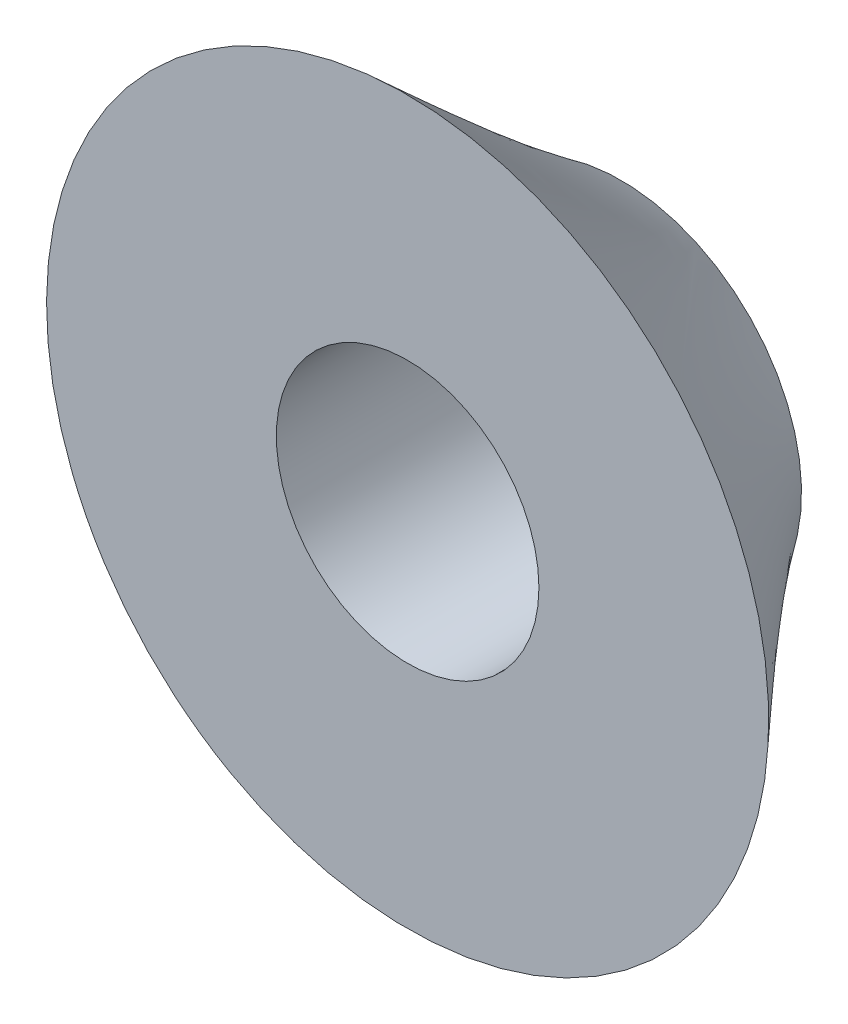
ISO-10303-21;
HEADER;
FILE_DESCRIPTION(('STEP AP214'),'2;1');
FILE_NAME('part.step','',(''),(''),'','','');
FILE_SCHEMA(('AUTOMOTIVE_DESIGN { 1 0 10303 214 1 1 1 1 }'));
ENDSEC;
DATA;
#1=APPLICATION_CONTEXT('core data for automotive mechanical design processes');
#2=APPLICATION_PROTOCOL_DEFINITION('international standard','automotive_design',2000,#1);
#3=PRODUCT_CONTEXT('',#1,'mechanical');
#4=PRODUCT('Part','Part','',(#3));
#5=PRODUCT_RELATED_PRODUCT_CATEGORY('part','',(#4));
#6=PRODUCT_DEFINITION_FORMATION('','',#4);
#7=PRODUCT_DEFINITION_CONTEXT('part definition',#1,'design');
#8=PRODUCT_DEFINITION('design','',#6,#7);
#9=PRODUCT_DEFINITION_SHAPE('','',#8);
#10=(LENGTH_UNIT() NAMED_UNIT(*) SI_UNIT(.MILLI.,.METRE.));
#11=(NAMED_UNIT(*) PLANE_ANGLE_UNIT() SI_UNIT($,.RADIAN.));
#12=(NAMED_UNIT(*) SI_UNIT($,.STERADIAN.) SOLID_ANGLE_UNIT());
#13=UNCERTAINTY_MEASURE_WITH_UNIT(LENGTH_MEASURE(1.E-05),#10,'distance_accuracy_value','');
#14=(GEOMETRIC_REPRESENTATION_CONTEXT(3) GLOBAL_UNCERTAINTY_ASSIGNED_CONTEXT((#13)) GLOBAL_UNIT_ASSIGNED_CONTEXT((#10,
#11,#12)) REPRESENTATION_CONTEXT('',''));
#15=CARTESIAN_POINT('',(0.,0.,0.));
#16=DIRECTION('',(0.,0.,1.));
#17=DIRECTION('',(1.,0.,0.));
#18=AXIS2_PLACEMENT_3D('',#15,#16,#17);
#19=CARTESIAN_POINT('',(0.,0.,6.5));
#20=DIRECTION('',(0.,0.,1.));
#21=DIRECTION('',(1.,0.,0.));
#22=AXIS2_PLACEMENT_3D('',#19,#20,#21);
#23=PLANE('',#22);
#24=CARTESIAN_POINT('',(0.,0.,6.5));
#25=DIRECTION('',(0.,0.,1.));
#26=DIRECTION('',(1.,0.,0.));
#27=AXIS2_PLACEMENT_3D('',#24,#25,#26);
#28=CIRCLE('',#27,4.);
#29=CARTESIAN_POINT('',(4.,0.,6.5));
#30=VERTEX_POINT('',#29);
#31=EDGE_CURVE('E49',#30,#30,#28,.T.);
#32=ORIENTED_EDGE('',*,*,#31,.F.);
#33=EDGE_LOOP('',(#32));
#34=FACE_BOUND('',#33,.T.);
#35=CARTESIAN_POINT('',(0.,0.,6.5));
#36=DIRECTION('',(0.,0.,1.));
#37=DIRECTION('',(1.,0.,0.));
#38=AXIS2_PLACEMENT_3D('',#35,#36,#37);
#39=CIRCLE('',#38,11.);
#40=CARTESIAN_POINT('',(8.27403430770523,7.24847268567088,6.5));
#41=VERTEX_POINT('',#40);
#42=EDGE_CURVE('E11',#41,#41,#39,.T.);
#43=ORIENTED_EDGE('',*,*,#42,.T.);
#44=EDGE_LOOP('',(#43));
#45=FACE_BOUND('',#44,.T.);
#46=ADVANCED_FACE('F35',(#34,#45),#23,.T.);
#47=CARTESIAN_POINT('',(0.,0.,0.));
#48=DIRECTION('',(0.,0.,1.));
#49=DIRECTION('',(1.,0.,0.));
#50=AXIS2_PLACEMENT_3D('',#47,#48,#49);
#51=PLANE('',#50);
#52=CARTESIAN_POINT('',(0.,0.,0.));
#53=DIRECTION('',(0.,0.,1.));
#54=DIRECTION('',(1.,0.,0.));
#55=AXIS2_PLACEMENT_3D('',#52,#53,#54);
#56=CIRCLE('',#55,4.);
#57=CARTESIAN_POINT('',(4.,0.,0.));
#58=VERTEX_POINT('',#57);
#59=EDGE_CURVE('E39',#58,#58,#56,.T.);
#60=ORIENTED_EDGE('',*,*,#59,.T.);
#61=EDGE_LOOP('',(#60));
#62=FACE_BOUND('',#61,.T.);
#63=CARTESIAN_POINT('',(0.,0.,0.));
#64=DIRECTION('',(0.,0.,1.));
#65=DIRECTION('',(1.,0.,0.));
#66=AXIS2_PLACEMENT_3D('',#63,#64,#65);
#67=CIRCLE('',#66,5.5);
#68=CARTESIAN_POINT('',(2.29477992513971,4.99839825295822,0.));
#69=VERTEX_POINT('',#68);
#70=EDGE_CURVE('E43',#69,#69,#67,.T.);
#71=ORIENTED_EDGE('',*,*,#70,.F.);
#72=EDGE_LOOP('',(#71));
#73=FACE_BOUND('',#72,.T.);
#74=ADVANCED_FACE('F69',(#62,#73),#51,.F.);
#75=CARTESIAN_POINT('',(2.29477992513971,4.99839825295822,0.));
#76=CARTESIAN_POINT('',(8.27403430770523,7.24847268567088,6.5));
#77=CARTESIAN_POINT('',(-7.70201658077673,9.58795810323764,0.));
#78=CARTESIAN_POINT('',(-6.22291106363654,23.7965413010813,6.5));
#79=CARTESIAN_POINT('',(-12.2915764310561,-0.408838402678803,0.));
#80=CARTESIAN_POINT('',(-22.770979679047,9.29959592973957,6.5));
#81=CARTESIAN_POINT('',(-2.29477992513971,-4.99839825295822,0.));
#82=CARTESIAN_POINT('',(-8.27403430770523,-7.24847268567088,6.5));
#83=CARTESIAN_POINT('',(7.70201658077673,-9.58795810323764,0.));
#84=CARTESIAN_POINT('',(6.22291106363653,-23.7965413010813,6.5));
#85=CARTESIAN_POINT('',(12.2915764310561,0.408838402678804,0.));
#86=CARTESIAN_POINT('',(22.770979679047,-9.29959592973957,6.5));
#87=CARTESIAN_POINT('',(2.29477992513971,4.99839825295822,0.));
#88=CARTESIAN_POINT('',(8.27403430770523,7.24847268567088,6.5));
#89=(BOUNDED_SURFACE() B_SPLINE_SURFACE(3,1,((#75,#76),(#77,#78),(#79,#80),(#81,#82),(#83,#84),
(#85,#86),(#87,#88)),.UNSPECIFIED.,.T.,.F.,.F.) B_SPLINE_SURFACE_WITH_KNOTS((4,3,4),(2,2),(0.,
0.5,1.),(0.,1.),.UNSPECIFIED.) GEOMETRIC_REPRESENTATION_ITEM() RATIONAL_B_SPLINE_SURFACE(((1.,
1.),(0.333333333333333,0.333333333333333),(0.333333333333333,0.333333333333333),(1.,1.),
(0.333333333333333,0.333333333333333),(0.333333333333333,0.333333333333333),(1.,1.))) REPRESENTATION_ITEM('') SURFACE());
#90=CARTESIAN_POINT('',(2.29477992513971,4.99839825295822,0.));
#91=CARTESIAN_POINT('',(2.3570638249581,5.02183652829898,0.0677083333333334));
#92=CARTESIAN_POINT('',(2.41934772477649,5.04527480363973,0.135416666666667));
#93=CARTESIAN_POINT('',(2.54391552441327,5.09215135432125,0.270833333333333));
#94=CARTESIAN_POINT('',(2.60619942423166,5.11558962966201,0.338541666666667));
#95=CARTESIAN_POINT('',(2.73076722386844,5.16246618034352,0.473958333333333));
#96=CARTESIAN_POINT('',(2.79305112368684,5.18590445568428,0.541666666666667));
#97=CARTESIAN_POINT('',(2.91761892332362,5.23278100636579,0.677083333333333));
#98=CARTESIAN_POINT('',(2.97990282314201,5.25621928170655,0.744791666666667));
#99=CARTESIAN_POINT('',(3.10447062277879,5.30309583238806,0.880208333333333));
#100=CARTESIAN_POINT('',(3.16675452259718,5.32653410772882,0.947916666666667));
#101=CARTESIAN_POINT('',(3.29132232223396,5.37341065841033,1.08333333333333));
#102=CARTESIAN_POINT('',(3.35360622205235,5.39684893375109,1.15104166666667));
#103=CARTESIAN_POINT('',(3.47817402168913,5.4437254844326,1.28645833333333));
#104=CARTESIAN_POINT('',(3.54045792150752,5.46716375977336,1.35416666666667));
#105=CARTESIAN_POINT('',(3.66502572114431,5.51404031045487,1.48958333333333));
#106=CARTESIAN_POINT('',(3.7273096209627,5.53747858579563,1.55729166666667));
#107=CARTESIAN_POINT('',(3.85187742059948,5.58435513647714,1.69270833333333));
#108=CARTESIAN_POINT('',(3.91416132041787,5.6077934118179,1.76041666666667));
#109=CARTESIAN_POINT('',(4.03872912005465,5.65466996249941,1.89583333333333));
#110=CARTESIAN_POINT('',(4.10101301987304,5.67810823784017,1.96354166666667));
#111=CARTESIAN_POINT('',(4.22558081950982,5.72498478852169,2.09895833333333));
#112=CARTESIAN_POINT('',(4.28786471932821,5.74842306386244,2.16666666666667));
#113=CARTESIAN_POINT('',(4.412432518965,5.79529961454396,2.30208333333333));
#114=CARTESIAN_POINT('',(4.47471641878339,5.81873788988471,2.36979166666667));
#115=CARTESIAN_POINT('',(4.59928421842017,5.86561444056623,2.50520833333333));
#116=CARTESIAN_POINT('',(4.66156811823856,5.88905271590698,2.57291666666667));
#117=CARTESIAN_POINT('',(4.78613591787534,5.9359292665885,2.70833333333333));
#118=CARTESIAN_POINT('',(4.84841981769373,5.95936754192925,2.77604166666667));
#119=CARTESIAN_POINT('',(4.97298761733051,6.00624409261077,2.91145833333333));
#120=CARTESIAN_POINT('',(5.0352715171489,6.02968236795152,2.97916666666667));
#121=CARTESIAN_POINT('',(5.15983931678569,6.07655891863304,3.11458333333333));
#122=CARTESIAN_POINT('',(5.22212321660408,6.0999971939738,3.18229166666667));
#123=CARTESIAN_POINT('',(5.34669101624086,6.14687374465531,3.31770833333333));
#124=CARTESIAN_POINT('',(5.40897491605925,6.17031201999607,3.38541666666667));
#125=CARTESIAN_POINT('',(5.53354271569603,6.21718857067758,3.52083333333333));
#126=CARTESIAN_POINT('',(5.59582661551442,6.24062684601834,3.58854166666667));
#127=CARTESIAN_POINT('',(5.7203944151512,6.28750339669985,3.72395833333333));
#128=CARTESIAN_POINT('',(5.78267831496959,6.31094167204061,3.79166666666667));
#129=CARTESIAN_POINT('',(5.90724611460638,6.35781822272212,3.92708333333333));
#130=CARTESIAN_POINT('',(5.96953001442477,6.38125649806288,3.99479166666667));
#131=CARTESIAN_POINT('',(6.09409781406155,6.42813304874439,4.13020833333333));
#132=CARTESIAN_POINT('',(6.15638171387994,6.45157132408515,4.19791666666667));
#133=CARTESIAN_POINT('',(6.28094951351672,6.49844787476666,4.33333333333333));
#134=CARTESIAN_POINT('',(6.34323341333511,6.52188615010742,4.40104166666667));
#135=CARTESIAN_POINT('',(6.46780121297189,6.56876270078893,4.53645833333333));
#136=CARTESIAN_POINT('',(6.53008511279028,6.59220097612969,4.60416666666667));
#137=CARTESIAN_POINT('',(6.65465291242706,6.6390775268112,4.73958333333333));
#138=CARTESIAN_POINT('',(6.71693681224546,6.66251580215196,4.80729166666667));
#139=CARTESIAN_POINT('',(6.84150461188224,6.70939235283348,4.94270833333333));
#140=CARTESIAN_POINT('',(6.90378851170063,6.73283062817423,5.01041666666667));
#141=CARTESIAN_POINT('',(7.02835631133741,6.77970717885575,5.14583333333333));
#142=CARTESIAN_POINT('',(7.0906402111558,6.8031454541965,5.21354166666667));
#143=CARTESIAN_POINT('',(7.21520801079258,6.85002200487802,5.34895833333333));
#144=CARTESIAN_POINT('',(7.27749191061097,6.87346028021877,5.41666666666667));
#145=CARTESIAN_POINT('',(7.40205971024775,6.92033683090029,5.55208333333333));
#146=CARTESIAN_POINT('',(7.46434361006615,6.94377510624104,5.61979166666667));
#147=CARTESIAN_POINT('',(7.58891140970293,6.99065165692256,5.75520833333333));
#148=CARTESIAN_POINT('',(7.65119530952132,7.01408993226332,5.82291666666667));
#149=CARTESIAN_POINT('',(7.7757631091581,7.06096648294483,5.95833333333333));
#150=CARTESIAN_POINT('',(7.83804700897649,7.08440475828559,6.02604166666667));
#151=CARTESIAN_POINT('',(7.96261480861327,7.1312813089671,6.16145833333333));
#152=CARTESIAN_POINT('',(8.02489870843166,7.15471958430786,6.22916666666667));
#153=CARTESIAN_POINT('',(8.14946650806844,7.20159613498937,6.36458333333333));
#154=CARTESIAN_POINT('',(8.21175040788683,7.22503441033013,6.43229166666667));
#155=CARTESIAN_POINT('',(8.27403430770523,7.24847268567088,6.5));
#156=B_SPLINE_CURVE_WITH_KNOTS('',3,(#90,#91,#92,#93,#94,#95,#96,#97,#98,#99,#100,#101,#102,
#103,#104,#105,#106,#107,#108,#109,#110,#111,#112,#113,#114,#115,#116,#117,#118,#119,#120,#121,
#122,#123,#124,#125,#126,#127,#128,#129,#130,#131,#132,#133,#134,#135,#136,#137,#138,#139,#140,
#141,#142,#143,#144,#145,#146,#147,#148,#149,#150,#151,#152,#153,#154,#155),.UNSPECIFIED.,.F.,
.F.,(4,2,2,2,2,2,2,2,2,2,2,2,2,2,2,2,2,2,2,2,2,2,2,2,2,2,2,2,2,2,2,2,4),(0.,0.28481133750753,
0.56962267501506,0.854434012522591,1.13924535003012,1.42405668753765,1.70886802504518,
1.99367936255271,2.27849070006024,2.56330203756777,2.8481133750753,3.13292471258283,
3.41773605009036,3.70254738759789,3.98735872510542,4.27217006261295,4.55698140012048,
4.84179273762801,5.12660407513554,5.41141541264307,5.6962267501506,5.98103808765813,
6.26584942516567,6.5506607626732,6.83547210018073,7.12028343768826,7.40509477519579,
7.68990611270332,7.97471745021085,8.25952878771838,8.54434012522591,8.82915146273344,
9.11396280024097),.UNSPECIFIED.);
#157=EDGE_CURVE('BSEAM78',#69,#41,#156,.T.);
#158=ORIENTED_EDGE('',*,*,#70,.T.);
#159=ORIENTED_EDGE('',*,*,#42,.F.);
#160=ORIENTED_EDGE('',*,*,#157,.T.);
#161=ORIENTED_EDGE('',*,*,#157,.F.);
#162=EDGE_LOOP('',(#158,#160,#159,#161));
#163=FACE_BOUND('',#162,.T.);
#164=ADVANCED_FACE('F78',(#163),#89,.T.);
#165=CARTESIAN_POINT('',(0.,0.,-0.0001));
#166=DIRECTION('',(0.,0.,1.));
#167=DIRECTION('',(1.,0.,0.));
#168=AXIS2_PLACEMENT_3D('',#165,#166,#167);
#169=CYLINDRICAL_SURFACE('',#168,4.);
#170=ORIENTED_EDGE('',*,*,#31,.T.);
#171=EDGE_LOOP('',(#170));
#172=FACE_BOUND('',#171,.T.);
#173=ORIENTED_EDGE('',*,*,#59,.F.);
#174=EDGE_LOOP('',(#173));
#175=FACE_BOUND('',#174,.T.);
#176=ADVANCED_FACE('F80',(#172,#175),#169,.F.);
#177=CLOSED_SHELL('',(#46,#74,#164,#176));
#178=MANIFOLD_SOLID_BREP('B2',#177);
#179=ADVANCED_BREP_SHAPE_REPRESENTATION('',(#18,#178),#14);
#180=SHAPE_DEFINITION_REPRESENTATION(#9,#179);
ENDSEC;
END-ISO-10303-21;
